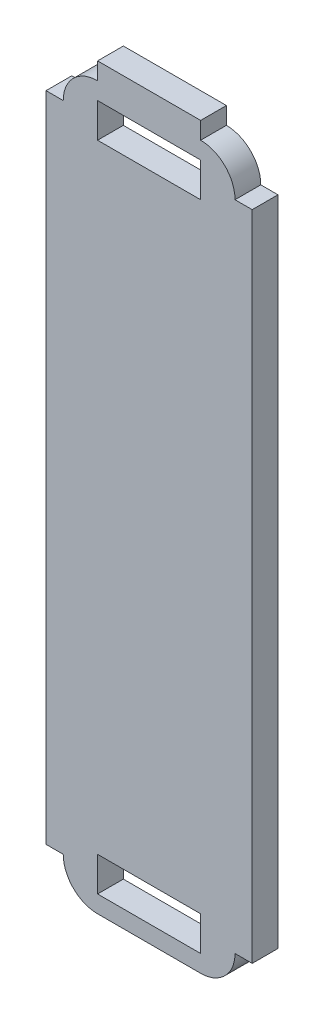
ISO-10303-21;
HEADER;
FILE_DESCRIPTION(('STEP AP214'),'2;1');
FILE_NAME('part.step','',(''),(''),'','','');
FILE_SCHEMA(('AUTOMOTIVE_DESIGN { 1 0 10303 214 1 1 1 1 }'));
ENDSEC;
DATA;
#1=APPLICATION_CONTEXT('core data for automotive mechanical design processes');
#2=APPLICATION_PROTOCOL_DEFINITION('international standard','automotive_design',2000,#1);
#3=PRODUCT_CONTEXT('',#1,'mechanical');
#4=PRODUCT('Part','Part','',(#3));
#5=PRODUCT_RELATED_PRODUCT_CATEGORY('part','',(#4));
#6=PRODUCT_DEFINITION_FORMATION('','',#4);
#7=PRODUCT_DEFINITION_CONTEXT('part definition',#1,'design');
#8=PRODUCT_DEFINITION('design','',#6,#7);
#9=PRODUCT_DEFINITION_SHAPE('','',#8);
#10=(LENGTH_UNIT() NAMED_UNIT(*) SI_UNIT(.MILLI.,.METRE.));
#11=(NAMED_UNIT(*) PLANE_ANGLE_UNIT() SI_UNIT($,.RADIAN.));
#12=(NAMED_UNIT(*) SI_UNIT($,.STERADIAN.) SOLID_ANGLE_UNIT());
#13=UNCERTAINTY_MEASURE_WITH_UNIT(LENGTH_MEASURE(1.E-05),#10,'distance_accuracy_value','');
#14=(GEOMETRIC_REPRESENTATION_CONTEXT(3) GLOBAL_UNCERTAINTY_ASSIGNED_CONTEXT((#13)) GLOBAL_UNIT_ASSIGNED_CONTEXT((#10,
#11,#12)) REPRESENTATION_CONTEXT('',''));
#15=CARTESIAN_POINT('',(0.,0.,0.));
#16=DIRECTION('',(0.,0.,1.));
#17=DIRECTION('',(1.,0.,0.));
#18=AXIS2_PLACEMENT_3D('',#15,#16,#17);
#19=CARTESIAN_POINT('',(0.,0.,1.5));
#20=DIRECTION('',(0.,1.,0.));
#21=DIRECTION('',(0.,0.,1.));
#22=AXIS2_PLACEMENT_3D('',#19,#20,#21);
#23=PLANE('',#22);
#24=DIRECTION('',(1.,0.,0.));
#25=VECTOR('',#24,1.);
#26=CARTESIAN_POINT('',(0.,0.,0.));
#27=LINE('',#26,#25);
#28=CARTESIAN_POINT('',(2.,0.,0.));
#29=VERTEX_POINT('',#28);
#30=CARTESIAN_POINT('',(8.,0.,0.));
#31=VERTEX_POINT('',#30);
#32=EDGE_CURVE('E370',#29,#31,#27,.T.);
#33=ORIENTED_EDGE('',*,*,#32,.T.);
#34=DIRECTION('',(0.,0.,-1.));
#35=VECTOR('',#34,1.);
#36=CARTESIAN_POINT('',(8.,0.,1.5));
#37=LINE('',#36,#35);
#38=CARTESIAN_POINT('',(8.,0.,1.5));
#39=VERTEX_POINT('',#38);
#40=EDGE_CURVE('E402',#31,#39,#37,.F.);
#41=ORIENTED_EDGE('',*,*,#40,.T.);
#42=DIRECTION('',(1.,0.,0.));
#43=VECTOR('',#42,1.);
#44=CARTESIAN_POINT('',(0.,0.,1.5));
#45=LINE('',#44,#43);
#46=CARTESIAN_POINT('',(2.,0.,1.5));
#47=VERTEX_POINT('',#46);
#48=EDGE_CURVE('E371',#47,#39,#45,.T.);
#49=ORIENTED_EDGE('',*,*,#48,.F.);
#50=DIRECTION('',(0.,0.,-1.));
#51=VECTOR('',#50,1.);
#52=CARTESIAN_POINT('',(2.,0.,1.5));
#53=LINE('',#52,#51);
#54=EDGE_CURVE('E398',#47,#29,#53,.T.);
#55=ORIENTED_EDGE('',*,*,#54,.T.);
#56=EDGE_LOOP('',(#33,#41,#49,#55));
#57=FACE_BOUND('',#56,.T.);
#58=ADVANCED_FACE('F39',(#57),#23,.F.);
#59=CARTESIAN_POINT('',(0.,0.,1.5));
#60=DIRECTION('',(0.,0.,-1.));
#61=DIRECTION('',(-1.,0.,0.));
#62=AXIS2_PLACEMENT_3D('',#59,#60,#61);
#63=PLANE('',#62);
#64=DIRECTION('',(1.,0.,0.));
#65=VECTOR('',#64,1.);
#66=CARTESIAN_POINT('',(8.,41.,1.5));
#67=LINE('',#66,#65);
#68=CARTESIAN_POINT('',(2.,41.,1.5));
#69=VERTEX_POINT('',#68);
#70=CARTESIAN_POINT('',(8.,41.,1.5));
#71=VERTEX_POINT('',#70);
#72=EDGE_CURVE('E202',#69,#71,#67,.T.);
#73=ORIENTED_EDGE('',*,*,#72,.T.);
#74=DIRECTION('',(0.,-1.,0.));
#75=VECTOR('',#74,1.);
#76=CARTESIAN_POINT('',(8.,41.,1.5));
#77=LINE('',#76,#75);
#78=CARTESIAN_POINT('',(8.,39.,1.5));
#79=VERTEX_POINT('',#78);
#80=EDGE_CURVE('E193',#71,#79,#77,.T.);
#81=ORIENTED_EDGE('',*,*,#80,.T.);
#82=DIRECTION('',(-1.,0.,0.));
#83=VECTOR('',#82,1.);
#84=CARTESIAN_POINT('',(8.,39.,1.5));
#85=LINE('',#84,#83);
#86=CARTESIAN_POINT('',(2.,39.,1.5));
#87=VERTEX_POINT('',#86);
#88=EDGE_CURVE('E205',#79,#87,#85,.T.);
#89=ORIENTED_EDGE('',*,*,#88,.T.);
#90=DIRECTION('',(0.,1.,0.));
#91=VECTOR('',#90,1.);
#92=CARTESIAN_POINT('',(2.,41.,1.5));
#93=LINE('',#92,#91);
#94=EDGE_CURVE('E55',#87,#69,#93,.T.);
#95=ORIENTED_EDGE('',*,*,#94,.T.);
#96=EDGE_LOOP('',(#73,#81,#89,#95));
#97=FACE_BOUND('',#96,.T.);
#98=DIRECTION('',(-1.,0.,0.));
#99=VECTOR('',#98,1.);
#100=CARTESIAN_POINT('',(2.,0.999999999999999,1.5));
#101=LINE('',#100,#99);
#102=CARTESIAN_POINT('',(8.,0.999999999999999,1.5));
#103=VERTEX_POINT('',#102);
#104=CARTESIAN_POINT('',(2.,0.999999999999999,1.5));
#105=VERTEX_POINT('',#104);
#106=EDGE_CURVE('E254',#103,#105,#101,.T.);
#107=ORIENTED_EDGE('',*,*,#106,.T.);
#108=DIRECTION('',(0.,1.,0.));
#109=VECTOR('',#108,1.);
#110=CARTESIAN_POINT('',(2.,0.999999999999999,1.5));
#111=LINE('',#110,#109);
#112=CARTESIAN_POINT('',(2.,3.,1.5));
#113=VERTEX_POINT('',#112);
#114=EDGE_CURVE('E243',#105,#113,#111,.T.);
#115=ORIENTED_EDGE('',*,*,#114,.T.);
#116=DIRECTION('',(1.,0.,0.));
#117=VECTOR('',#116,1.);
#118=CARTESIAN_POINT('',(2.,3.,1.5));
#119=LINE('',#118,#117);
#120=CARTESIAN_POINT('',(8.,3.,1.5));
#121=VERTEX_POINT('',#120);
#122=EDGE_CURVE('E247',#113,#121,#119,.T.);
#123=ORIENTED_EDGE('',*,*,#122,.T.);
#124=DIRECTION('',(0.,-1.,0.));
#125=VECTOR('',#124,1.);
#126=CARTESIAN_POINT('',(8.,0.999999999999999,1.5));
#127=LINE('',#126,#125);
#128=EDGE_CURVE('E63',#121,#103,#127,.T.);
#129=ORIENTED_EDGE('',*,*,#128,.T.);
#130=EDGE_LOOP('',(#107,#115,#123,#129));
#131=FACE_BOUND('',#130,.T.);
#132=ORIENTED_EDGE('',*,*,#48,.T.);
#133=CARTESIAN_POINT('',(8.,2.,1.5));
#134=DIRECTION('',(0.,0.,-1.));
#135=DIRECTION('',(-1.,0.,0.));
#136=AXIS2_PLACEMENT_3D('',#133,#134,#135);
#137=CIRCLE('',#136,2.);
#138=CARTESIAN_POINT('',(10.,2.,1.5));
#139=VERTEX_POINT('',#138);
#140=EDGE_CURVE('E414',#39,#139,#137,.F.);
#141=ORIENTED_EDGE('',*,*,#140,.T.);
#142=DIRECTION('',(-1.,0.,0.));
#143=VECTOR('',#142,1.);
#144=CARTESIAN_POINT('',(11.,2.,1.5));
#145=LINE('',#144,#143);
#146=CARTESIAN_POINT('',(11.,2.,1.5));
#147=VERTEX_POINT('',#146);
#148=EDGE_CURVE('E366',#147,#139,#145,.T.);
#149=ORIENTED_EDGE('',*,*,#148,.F.);
#150=DIRECTION('',(0.,-1.,0.));
#151=VECTOR('',#150,1.);
#152=CARTESIAN_POINT('',(11.,40.,1.5));
#153=LINE('',#152,#151);
#154=CARTESIAN_POINT('',(11.,40.,1.5));
#155=VERTEX_POINT('',#154);
#156=EDGE_CURVE('E341',#155,#147,#153,.T.);
#157=ORIENTED_EDGE('',*,*,#156,.F.);
#158=DIRECTION('',(-1.,0.,0.));
#159=VECTOR('',#158,1.);
#160=CARTESIAN_POINT('',(11.,40.,1.5));
#161=LINE('',#160,#159);
#162=CARTESIAN_POINT('',(10.,40.,1.5));
#163=VERTEX_POINT('',#162);
#164=EDGE_CURVE('E354',#155,#163,#161,.T.);
#165=ORIENTED_EDGE('',*,*,#164,.T.);
#166=CARTESIAN_POINT('',(8.,40.,1.5));
#167=DIRECTION('',(0.,0.,-1.));
#168=DIRECTION('',(-1.,0.,0.));
#169=AXIS2_PLACEMENT_3D('',#166,#167,#168);
#170=CIRCLE('',#169,2.);
#171=CARTESIAN_POINT('',(8.,42.,1.5));
#172=VERTEX_POINT('',#171);
#173=EDGE_CURVE('E408',#163,#172,#170,.F.);
#174=ORIENTED_EDGE('',*,*,#173,.T.);
#175=DIRECTION('',(0.,-1.,0.));
#176=VECTOR('',#175,1.);
#177=CARTESIAN_POINT('',(8.,43.,1.5));
#178=LINE('',#177,#176);
#179=CARTESIAN_POINT('',(8.,43.,1.5));
#180=VERTEX_POINT('',#179);
#181=EDGE_CURVE('E304',#180,#172,#178,.T.);
#182=ORIENTED_EDGE('',*,*,#181,.F.);
#183=DIRECTION('',(1.,0.,0.));
#184=VECTOR('',#183,1.);
#185=CARTESIAN_POINT('',(2.,43.,1.5));
#186=LINE('',#185,#184);
#187=CARTESIAN_POINT('',(2.,43.,1.5));
#188=VERTEX_POINT('',#187);
#189=EDGE_CURVE('E287',#188,#180,#186,.T.);
#190=ORIENTED_EDGE('',*,*,#189,.F.);
#191=DIRECTION('',(0.,-1.,0.));
#192=VECTOR('',#191,1.);
#193=CARTESIAN_POINT('',(2.,43.,1.5));
#194=LINE('',#193,#192);
#195=CARTESIAN_POINT('',(2.,42.,1.5));
#196=VERTEX_POINT('',#195);
#197=EDGE_CURVE('E308',#188,#196,#194,.T.);
#198=ORIENTED_EDGE('',*,*,#197,.T.);
#199=CARTESIAN_POINT('',(2.,40.,1.5));
#200=DIRECTION('',(0.,0.,-1.));
#201=DIRECTION('',(-1.,0.,0.));
#202=AXIS2_PLACEMENT_3D('',#199,#200,#201);
#203=CIRCLE('',#202,2.);
#204=CARTESIAN_POINT('',(0.,40.,1.5));
#205=VERTEX_POINT('',#204);
#206=EDGE_CURVE('E405',#196,#205,#203,.F.);
#207=ORIENTED_EDGE('',*,*,#206,.T.);
#208=DIRECTION('',(1.,0.,0.));
#209=VECTOR('',#208,1.);
#210=CARTESIAN_POINT('',(-1.,40.,1.5));
#211=LINE('',#210,#209);
#212=CARTESIAN_POINT('',(-1.,40.,1.5));
#213=VERTEX_POINT('',#212);
#214=EDGE_CURVE('E329',#213,#205,#211,.T.);
#215=ORIENTED_EDGE('',*,*,#214,.F.);
#216=DIRECTION('',(0.,1.,0.));
#217=VECTOR('',#216,1.);
#218=CARTESIAN_POINT('',(-1.,40.,1.5));
#219=LINE('',#218,#217);
#220=CARTESIAN_POINT('',(-1.,2.,1.5));
#221=VERTEX_POINT('',#220);
#222=EDGE_CURVE('E319',#221,#213,#219,.T.);
#223=ORIENTED_EDGE('',*,*,#222,.F.);
#224=DIRECTION('',(1.,0.,0.));
#225=VECTOR('',#224,1.);
#226=CARTESIAN_POINT('',(-1.,2.,1.5));
#227=LINE('',#226,#225);
#228=CARTESIAN_POINT('',(0.,2.,1.5));
#229=VERTEX_POINT('',#228);
#230=EDGE_CURVE('E333',#221,#229,#227,.T.);
#231=ORIENTED_EDGE('',*,*,#230,.T.);
#232=CARTESIAN_POINT('',(2.,2.,1.5));
#233=DIRECTION('',(0.,0.,-1.));
#234=DIRECTION('',(-1.,0.,0.));
#235=AXIS2_PLACEMENT_3D('',#232,#233,#234);
#236=CIRCLE('',#235,2.);
#237=EDGE_CURVE('E411',#229,#47,#236,.F.);
#238=ORIENTED_EDGE('',*,*,#237,.T.);
#239=EDGE_LOOP('',(#132,#141,#149,#157,#165,#174,#182,#190,#198,#207,#215,#223,#231,#238));
#240=FACE_BOUND('',#239,.T.);
#241=ADVANCED_FACE('F210',(#97,#131,#240),#63,.F.);
#242=CARTESIAN_POINT('',(0.,0.,0.));
#243=DIRECTION('',(0.,0.,-1.));
#244=DIRECTION('',(-1.,0.,0.));
#245=AXIS2_PLACEMENT_3D('',#242,#243,#244);
#246=PLANE('',#245);
#247=DIRECTION('',(0.,-1.,0.));
#248=VECTOR('',#247,1.);
#249=CARTESIAN_POINT('',(8.,41.,0.));
#250=LINE('',#249,#248);
#251=CARTESIAN_POINT('',(8.,41.,0.));
#252=VERTEX_POINT('',#251);
#253=CARTESIAN_POINT('',(8.,39.,0.));
#254=VERTEX_POINT('',#253);
#255=EDGE_CURVE('E196',#252,#254,#250,.T.);
#256=ORIENTED_EDGE('',*,*,#255,.F.);
#257=DIRECTION('',(1.,0.,0.));
#258=VECTOR('',#257,1.);
#259=CARTESIAN_POINT('',(8.,41.,0.));
#260=LINE('',#259,#258);
#261=CARTESIAN_POINT('',(2.,41.,0.));
#262=VERTEX_POINT('',#261);
#263=EDGE_CURVE('E214',#262,#252,#260,.T.);
#264=ORIENTED_EDGE('',*,*,#263,.F.);
#265=DIRECTION('',(0.,1.,0.));
#266=VECTOR('',#265,1.);
#267=CARTESIAN_POINT('',(2.,41.,0.));
#268=LINE('',#267,#266);
#269=CARTESIAN_POINT('',(2.,39.,0.));
#270=VERTEX_POINT('',#269);
#271=EDGE_CURVE('E218',#270,#262,#268,.T.);
#272=ORIENTED_EDGE('',*,*,#271,.F.);
#273=DIRECTION('',(-1.,0.,0.));
#274=VECTOR('',#273,1.);
#275=CARTESIAN_POINT('',(8.,39.,0.));
#276=LINE('',#275,#274);
#277=EDGE_CURVE('E227',#254,#270,#276,.T.);
#278=ORIENTED_EDGE('',*,*,#277,.F.);
#279=EDGE_LOOP('',(#256,#264,#272,#278));
#280=FACE_BOUND('',#279,.T.);
#281=DIRECTION('',(0.,1.,0.));
#282=VECTOR('',#281,1.);
#283=CARTESIAN_POINT('',(2.,0.999999999999999,0.));
#284=LINE('',#283,#282);
#285=CARTESIAN_POINT('',(2.,0.999999999999999,0.));
#286=VERTEX_POINT('',#285);
#287=CARTESIAN_POINT('',(2.,3.,0.));
#288=VERTEX_POINT('',#287);
#289=EDGE_CURVE('E259',#286,#288,#284,.T.);
#290=ORIENTED_EDGE('',*,*,#289,.F.);
#291=DIRECTION('',(-1.,0.,0.));
#292=VECTOR('',#291,1.);
#293=CARTESIAN_POINT('',(2.,0.999999999999999,0.));
#294=LINE('',#293,#292);
#295=CARTESIAN_POINT('',(8.,0.999999999999999,0.));
#296=VERTEX_POINT('',#295);
#297=EDGE_CURVE('E248',#296,#286,#294,.T.);
#298=ORIENTED_EDGE('',*,*,#297,.F.);
#299=DIRECTION('',(0.,-1.,0.));
#300=VECTOR('',#299,1.);
#301=CARTESIAN_POINT('',(8.,0.999999999999999,0.));
#302=LINE('',#301,#300);
#303=CARTESIAN_POINT('',(8.,3.,0.));
#304=VERTEX_POINT('',#303);
#305=EDGE_CURVE('E266',#304,#296,#302,.T.);
#306=ORIENTED_EDGE('',*,*,#305,.F.);
#307=DIRECTION('',(1.,0.,0.));
#308=VECTOR('',#307,1.);
#309=CARTESIAN_POINT('',(2.,3.,0.));
#310=LINE('',#309,#308);
#311=EDGE_CURVE('E262',#288,#304,#310,.T.);
#312=ORIENTED_EDGE('',*,*,#311,.F.);
#313=EDGE_LOOP('',(#290,#298,#306,#312));
#314=FACE_BOUND('',#313,.T.);
#315=CARTESIAN_POINT('',(8.,40.,0.));
#316=DIRECTION('',(0.,0.,-1.));
#317=DIRECTION('',(-1.,0.,0.));
#318=AXIS2_PLACEMENT_3D('',#315,#316,#317);
#319=CIRCLE('',#318,2.);
#320=CARTESIAN_POINT('',(8.,42.,0.));
#321=VERTEX_POINT('',#320);
#322=CARTESIAN_POINT('',(10.,40.,0.));
#323=VERTEX_POINT('',#322);
#324=EDGE_CURVE('E389',#321,#323,#319,.T.);
#325=ORIENTED_EDGE('',*,*,#324,.T.);
#326=DIRECTION('',(-1.,0.,0.));
#327=VECTOR('',#326,1.);
#328=CARTESIAN_POINT('',(11.,40.,0.));
#329=LINE('',#328,#327);
#330=CARTESIAN_POINT('',(11.,40.,0.));
#331=VERTEX_POINT('',#330);
#332=EDGE_CURVE('E358',#331,#323,#329,.T.);
#333=ORIENTED_EDGE('',*,*,#332,.F.);
#334=DIRECTION('',(0.,1.,0.));
#335=VECTOR('',#334,1.);
#336=CARTESIAN_POINT('',(11.,40.,0.));
#337=LINE('',#336,#335);
#338=CARTESIAN_POINT('',(11.,2.,0.));
#339=VERTEX_POINT('',#338);
#340=EDGE_CURVE('E348',#339,#331,#337,.T.);
#341=ORIENTED_EDGE('',*,*,#340,.F.);
#342=DIRECTION('',(-1.,0.,0.));
#343=VECTOR('',#342,1.);
#344=CARTESIAN_POINT('',(11.,2.,0.));
#345=LINE('',#344,#343);
#346=CARTESIAN_POINT('',(10.,2.,0.));
#347=VERTEX_POINT('',#346);
#348=EDGE_CURVE('E362',#339,#347,#345,.T.);
#349=ORIENTED_EDGE('',*,*,#348,.T.);
#350=CARTESIAN_POINT('',(8.,2.,0.));
#351=DIRECTION('',(0.,0.,-1.));
#352=DIRECTION('',(-1.,0.,0.));
#353=AXIS2_PLACEMENT_3D('',#350,#351,#352);
#354=CIRCLE('',#353,2.);
#355=EDGE_CURVE('E395',#347,#31,#354,.T.);
#356=ORIENTED_EDGE('',*,*,#355,.T.);
#357=ORIENTED_EDGE('',*,*,#32,.F.);
#358=CARTESIAN_POINT('',(2.,2.,0.));
#359=DIRECTION('',(0.,0.,-1.));
#360=DIRECTION('',(-1.,0.,0.));
#361=AXIS2_PLACEMENT_3D('',#358,#359,#360);
#362=CIRCLE('',#361,2.);
#363=CARTESIAN_POINT('',(0.,2.,0.));
#364=VERTEX_POINT('',#363);
#365=EDGE_CURVE('E392',#29,#364,#362,.T.);
#366=ORIENTED_EDGE('',*,*,#365,.T.);
#367=DIRECTION('',(1.,0.,0.));
#368=VECTOR('',#367,1.);
#369=CARTESIAN_POINT('',(-1.,2.,0.));
#370=LINE('',#369,#368);
#371=CARTESIAN_POINT('',(-1.,2.,0.));
#372=VERTEX_POINT('',#371);
#373=EDGE_CURVE('E337',#372,#364,#370,.T.);
#374=ORIENTED_EDGE('',*,*,#373,.F.);
#375=DIRECTION('',(0.,-1.,0.));
#376=VECTOR('',#375,1.);
#377=CARTESIAN_POINT('',(-1.,40.,0.));
#378=LINE('',#377,#376);
#379=CARTESIAN_POINT('',(-1.,40.,0.));
#380=VERTEX_POINT('',#379);
#381=EDGE_CURVE('E312',#380,#372,#378,.T.);
#382=ORIENTED_EDGE('',*,*,#381,.F.);
#383=DIRECTION('',(1.,0.,0.));
#384=VECTOR('',#383,1.);
#385=CARTESIAN_POINT('',(-1.,40.,0.));
#386=LINE('',#385,#384);
#387=CARTESIAN_POINT('',(0.,40.,0.));
#388=VERTEX_POINT('',#387);
#389=EDGE_CURVE('E325',#380,#388,#386,.T.);
#390=ORIENTED_EDGE('',*,*,#389,.T.);
#391=CARTESIAN_POINT('',(2.,40.,0.));
#392=DIRECTION('',(0.,0.,-1.));
#393=DIRECTION('',(-1.,0.,0.));
#394=AXIS2_PLACEMENT_3D('',#391,#392,#393);
#395=CIRCLE('',#394,2.);
#396=CARTESIAN_POINT('',(2.,42.,0.));
#397=VERTEX_POINT('',#396);
#398=EDGE_CURVE('E386',#388,#397,#395,.T.);
#399=ORIENTED_EDGE('',*,*,#398,.T.);
#400=DIRECTION('',(0.,-1.,0.));
#401=VECTOR('',#400,1.);
#402=CARTESIAN_POINT('',(2.,43.,0.));
#403=LINE('',#402,#401);
#404=CARTESIAN_POINT('',(2.,43.,0.));
#405=VERTEX_POINT('',#404);
#406=EDGE_CURVE('E296',#405,#397,#403,.T.);
#407=ORIENTED_EDGE('',*,*,#406,.F.);
#408=DIRECTION('',(-1.,0.,0.));
#409=VECTOR('',#408,1.);
#410=CARTESIAN_POINT('',(2.,43.,0.));
#411=LINE('',#410,#409);
#412=CARTESIAN_POINT('',(8.,43.,0.));
#413=VERTEX_POINT('',#412);
#414=EDGE_CURVE('E293',#413,#405,#411,.T.);
#415=ORIENTED_EDGE('',*,*,#414,.F.);
#416=DIRECTION('',(0.,-1.,0.));
#417=VECTOR('',#416,1.);
#418=CARTESIAN_POINT('',(8.,43.,0.));
#419=LINE('',#418,#417);
#420=EDGE_CURVE('E300',#413,#321,#419,.T.);
#421=ORIENTED_EDGE('',*,*,#420,.T.);
#422=EDGE_LOOP('',(#325,#333,#341,#349,#356,#357,#366,#374,#382,#390,#399,#407,#415,#421));
#423=FACE_BOUND('',#422,.T.);
#424=ADVANCED_FACE('F443',(#280,#314,#423),#246,.T.);
#425=CARTESIAN_POINT('',(8.,2.,1.5));
#426=DIRECTION('',(0.,0.,-1.));
#427=DIRECTION('',(-1.,0.,0.));
#428=AXIS2_PLACEMENT_3D('',#425,#426,#427);
#429=CYLINDRICAL_SURFACE('',#428,2.);
#430=ORIENTED_EDGE('',*,*,#140,.F.);
#431=ORIENTED_EDGE('',*,*,#40,.F.);
#432=ORIENTED_EDGE('',*,*,#355,.F.);
#433=DIRECTION('',(0.,0.,-1.));
#434=VECTOR('',#433,1.);
#435=CARTESIAN_POINT('',(10.,2.,1.5));
#436=LINE('',#435,#434);
#437=EDGE_CURVE('E382',#139,#347,#436,.T.);
#438=ORIENTED_EDGE('',*,*,#437,.F.);
#439=EDGE_LOOP('',(#430,#431,#432,#438));
#440=FACE_BOUND('',#439,.T.);
#441=ADVANCED_FACE('F466',(#440),#429,.T.);
#442=CARTESIAN_POINT('',(2.,2.,1.5));
#443=DIRECTION('',(0.,0.,-1.));
#444=DIRECTION('',(-1.,0.,0.));
#445=AXIS2_PLACEMENT_3D('',#442,#443,#444);
#446=CYLINDRICAL_SURFACE('',#445,2.);
#447=ORIENTED_EDGE('',*,*,#237,.F.);
#448=DIRECTION('',(0.,0.,-1.));
#449=VECTOR('',#448,1.);
#450=CARTESIAN_POINT('',(0.,2.,1.5));
#451=LINE('',#450,#449);
#452=EDGE_CURVE('E421',#364,#229,#451,.F.);
#453=ORIENTED_EDGE('',*,*,#452,.F.);
#454=ORIENTED_EDGE('',*,*,#365,.F.);
#455=ORIENTED_EDGE('',*,*,#54,.F.);
#456=EDGE_LOOP('',(#447,#453,#454,#455));
#457=FACE_BOUND('',#456,.T.);
#458=ADVANCED_FACE('F458',(#457),#446,.T.);
#459=CARTESIAN_POINT('',(8.,40.,1.5));
#460=DIRECTION('',(0.,0.,-1.));
#461=DIRECTION('',(-1.,0.,0.));
#462=AXIS2_PLACEMENT_3D('',#459,#460,#461);
#463=CYLINDRICAL_SURFACE('',#462,2.);
#464=ORIENTED_EDGE('',*,*,#173,.F.);
#465=DIRECTION('',(0.,0.,-1.));
#466=VECTOR('',#465,1.);
#467=CARTESIAN_POINT('',(10.,40.,1.5));
#468=LINE('',#467,#466);
#469=EDGE_CURVE('E375',#323,#163,#468,.F.);
#470=ORIENTED_EDGE('',*,*,#469,.F.);
#471=ORIENTED_EDGE('',*,*,#324,.F.);
#472=DIRECTION('',(0.,0.,-1.));
#473=VECTOR('',#472,1.);
#474=CARTESIAN_POINT('',(8.,42.,1.5));
#475=LINE('',#474,#473);
#476=EDGE_CURVE('E11',#172,#321,#475,.T.);
#477=ORIENTED_EDGE('',*,*,#476,.F.);
#478=EDGE_LOOP('',(#464,#470,#471,#477));
#479=FACE_BOUND('',#478,.T.);
#480=ADVANCED_FACE('F484',(#479),#463,.T.);
#481=CARTESIAN_POINT('',(2.,40.,1.5));
#482=DIRECTION('',(0.,0.,-1.));
#483=DIRECTION('',(-1.,0.,0.));
#484=AXIS2_PLACEMENT_3D('',#481,#482,#483);
#485=CYLINDRICAL_SURFACE('',#484,2.);
#486=ORIENTED_EDGE('',*,*,#206,.F.);
#487=DIRECTION('',(0.,0.,-1.));
#488=VECTOR('',#487,1.);
#489=CARTESIAN_POINT('',(2.,42.,1.5));
#490=LINE('',#489,#488);
#491=EDGE_CURVE('E48',#397,#196,#490,.F.);
#492=ORIENTED_EDGE('',*,*,#491,.F.);
#493=ORIENTED_EDGE('',*,*,#398,.F.);
#494=DIRECTION('',(0.,0.,-1.));
#495=VECTOR('',#494,1.);
#496=CARTESIAN_POINT('',(0.,40.,1.5));
#497=LINE('',#496,#495);
#498=EDGE_CURVE('E417',#205,#388,#497,.T.);
#499=ORIENTED_EDGE('',*,*,#498,.F.);
#500=EDGE_LOOP('',(#486,#492,#493,#499));
#501=FACE_BOUND('',#500,.T.);
#502=ADVANCED_FACE('F41',(#501),#485,.T.);
#503=CARTESIAN_POINT('',(11.,2.,1.5));
#504=DIRECTION('',(0.,1.,0.));
#505=DIRECTION('',(0.,0.,1.));
#506=AXIS2_PLACEMENT_3D('',#503,#504,#505);
#507=PLANE('',#506);
#508=ORIENTED_EDGE('',*,*,#437,.T.);
#509=ORIENTED_EDGE('',*,*,#348,.F.);
#510=DIRECTION('',(0.,0.,-1.));
#511=VECTOR('',#510,1.);
#512=CARTESIAN_POINT('',(11.,2.,1.5));
#513=LINE('',#512,#511);
#514=EDGE_CURVE('E345',#147,#339,#513,.T.);
#515=ORIENTED_EDGE('',*,*,#514,.F.);
#516=ORIENTED_EDGE('',*,*,#148,.T.);
#517=EDGE_LOOP('',(#508,#509,#515,#516));
#518=FACE_BOUND('',#517,.T.);
#519=ADVANCED_FACE('F471',(#518),#507,.F.);
#520=CARTESIAN_POINT('',(11.,40.,1.5));
#521=DIRECTION('',(0.,-1.,0.));
#522=DIRECTION('',(0.,0.,-1.));
#523=AXIS2_PLACEMENT_3D('',#520,#521,#522);
#524=PLANE('',#523);
#525=ORIENTED_EDGE('',*,*,#469,.T.);
#526=ORIENTED_EDGE('',*,*,#164,.F.);
#527=DIRECTION('',(0.,0.,1.));
#528=VECTOR('',#527,1.);
#529=CARTESIAN_POINT('',(11.,40.,1.5));
#530=LINE('',#529,#528);
#531=EDGE_CURVE('E351',#331,#155,#530,.T.);
#532=ORIENTED_EDGE('',*,*,#531,.F.);
#533=ORIENTED_EDGE('',*,*,#332,.T.);
#534=EDGE_LOOP('',(#525,#526,#532,#533));
#535=FACE_BOUND('',#534,.T.);
#536=ADVANCED_FACE('F480',(#535),#524,.F.);
#537=CARTESIAN_POINT('',(11.,0.,0.));
#538=DIRECTION('',(1.,0.,0.));
#539=DIRECTION('',(0.,0.,-1.));
#540=AXIS2_PLACEMENT_3D('',#537,#538,#539);
#541=PLANE('',#540);
#542=ORIENTED_EDGE('',*,*,#156,.T.);
#543=ORIENTED_EDGE('',*,*,#514,.T.);
#544=ORIENTED_EDGE('',*,*,#340,.T.);
#545=ORIENTED_EDGE('',*,*,#531,.T.);
#546=EDGE_LOOP('',(#542,#543,#544,#545));
#547=FACE_BOUND('',#546,.T.);
#548=ADVANCED_FACE('F475',(#547),#541,.T.);
#549=CARTESIAN_POINT('',(-1.,2.,0.));
#550=DIRECTION('',(0.,1.,0.));
#551=DIRECTION('',(0.,0.,1.));
#552=AXIS2_PLACEMENT_3D('',#549,#550,#551);
#553=PLANE('',#552);
#554=ORIENTED_EDGE('',*,*,#452,.T.);
#555=ORIENTED_EDGE('',*,*,#230,.F.);
#556=DIRECTION('',(0.,0.,1.));
#557=VECTOR('',#556,1.);
#558=CARTESIAN_POINT('',(-1.,2.,0.));
#559=LINE('',#558,#557);
#560=EDGE_CURVE('E316',#372,#221,#559,.T.);
#561=ORIENTED_EDGE('',*,*,#560,.F.);
#562=ORIENTED_EDGE('',*,*,#373,.T.);
#563=EDGE_LOOP('',(#554,#555,#561,#562));
#564=FACE_BOUND('',#563,.T.);
#565=ADVANCED_FACE('F455',(#564),#553,.F.);
#566=CARTESIAN_POINT('',(-1.,40.,0.));
#567=DIRECTION('',(0.,-1.,0.));
#568=DIRECTION('',(0.,0.,-1.));
#569=AXIS2_PLACEMENT_3D('',#566,#567,#568);
#570=PLANE('',#569);
#571=ORIENTED_EDGE('',*,*,#498,.T.);
#572=ORIENTED_EDGE('',*,*,#389,.F.);
#573=DIRECTION('',(0.,0.,-1.));
#574=VECTOR('',#573,1.);
#575=CARTESIAN_POINT('',(-1.,40.,0.));
#576=LINE('',#575,#574);
#577=EDGE_CURVE('E322',#213,#380,#576,.T.);
#578=ORIENTED_EDGE('',*,*,#577,.F.);
#579=ORIENTED_EDGE('',*,*,#214,.T.);
#580=EDGE_LOOP('',(#571,#572,#578,#579));
#581=FACE_BOUND('',#580,.T.);
#582=ADVANCED_FACE('F449',(#581),#570,.F.);
#583=CARTESIAN_POINT('',(-1.,0.,0.));
#584=DIRECTION('',(-1.,0.,0.));
#585=DIRECTION('',(0.,0.,1.));
#586=AXIS2_PLACEMENT_3D('',#583,#584,#585);
#587=PLANE('',#586);
#588=ORIENTED_EDGE('',*,*,#381,.T.);
#589=ORIENTED_EDGE('',*,*,#560,.T.);
#590=ORIENTED_EDGE('',*,*,#222,.T.);
#591=ORIENTED_EDGE('',*,*,#577,.T.);
#592=EDGE_LOOP('',(#588,#589,#590,#591));
#593=FACE_BOUND('',#592,.T.);
#594=ADVANCED_FACE('F453',(#593),#587,.T.);
#595=CARTESIAN_POINT('',(2.,43.,0.));
#596=DIRECTION('',(1.,0.,0.));
#597=DIRECTION('',(0.,0.,-1.));
#598=AXIS2_PLACEMENT_3D('',#595,#596,#597);
#599=PLANE('',#598);
#600=ORIENTED_EDGE('',*,*,#491,.T.);
#601=ORIENTED_EDGE('',*,*,#197,.F.);
#602=DIRECTION('',(0.,0.,1.));
#603=VECTOR('',#602,1.);
#604=CARTESIAN_POINT('',(2.,43.,0.));
#605=LINE('',#604,#603);
#606=EDGE_CURVE('E237',#405,#188,#605,.T.);
#607=ORIENTED_EDGE('',*,*,#606,.F.);
#608=ORIENTED_EDGE('',*,*,#406,.T.);
#609=EDGE_LOOP('',(#600,#601,#607,#608));
#610=FACE_BOUND('',#609,.T.);
#611=ADVANCED_FACE('F429',(#610),#599,.F.);
#612=CARTESIAN_POINT('',(8.,43.,0.));
#613=DIRECTION('',(-1.,0.,0.));
#614=DIRECTION('',(0.,0.,1.));
#615=AXIS2_PLACEMENT_3D('',#612,#613,#614);
#616=PLANE('',#615);
#617=ORIENTED_EDGE('',*,*,#476,.T.);
#618=ORIENTED_EDGE('',*,*,#420,.F.);
#619=DIRECTION('',(0.,0.,-1.));
#620=VECTOR('',#619,1.);
#621=CARTESIAN_POINT('',(8.,43.,0.));
#622=LINE('',#621,#620);
#623=EDGE_CURVE('E290',#180,#413,#622,.T.);
#624=ORIENTED_EDGE('',*,*,#623,.F.);
#625=ORIENTED_EDGE('',*,*,#181,.T.);
#626=EDGE_LOOP('',(#617,#618,#624,#625));
#627=FACE_BOUND('',#626,.T.);
#628=ADVANCED_FACE('F486',(#627),#616,.F.);
#629=CARTESIAN_POINT('',(0.,43.,0.));
#630=DIRECTION('',(0.,1.,0.));
#631=DIRECTION('',(0.,0.,1.));
#632=AXIS2_PLACEMENT_3D('',#629,#630,#631);
#633=PLANE('',#632);
#634=ORIENTED_EDGE('',*,*,#606,.T.);
#635=ORIENTED_EDGE('',*,*,#189,.T.);
#636=ORIENTED_EDGE('',*,*,#623,.T.);
#637=ORIENTED_EDGE('',*,*,#414,.T.);
#638=EDGE_LOOP('',(#634,#635,#636,#637));
#639=FACE_BOUND('',#638,.T.);
#640=ADVANCED_FACE('F439',(#639),#633,.T.);
#641=CARTESIAN_POINT('',(2.,0.999999999999999,1.5));
#642=DIRECTION('',(-1.,0.,0.));
#643=DIRECTION('',(0.,-1.,0.));
#644=AXIS2_PLACEMENT_3D('',#641,#642,#643);
#645=PLANE('',#644);
#646=ORIENTED_EDGE('',*,*,#289,.T.);
#647=DIRECTION('',(0.,0.,-1.));
#648=VECTOR('',#647,1.);
#649=CARTESIAN_POINT('',(2.,3.,1.5));
#650=LINE('',#649,#648);
#651=EDGE_CURVE('E258',#113,#288,#650,.T.);
#652=ORIENTED_EDGE('',*,*,#651,.F.);
#653=ORIENTED_EDGE('',*,*,#114,.F.);
#654=DIRECTION('',(0.,0.,-1.));
#655=VECTOR('',#654,1.);
#656=CARTESIAN_POINT('',(2.,0.999999999999999,1.5));
#657=LINE('',#656,#655);
#658=EDGE_CURVE('E228',#105,#286,#657,.T.);
#659=ORIENTED_EDGE('',*,*,#658,.T.);
#660=EDGE_LOOP('',(#646,#652,#653,#659));
#661=FACE_BOUND('',#660,.T.);
#662=ADVANCED_FACE('F493',(#661),#645,.F.);
#663=CARTESIAN_POINT('',(2.,0.999999999999999,1.5));
#664=DIRECTION('',(0.,-1.,0.));
#665=DIRECTION('',(0.,0.,-1.));
#666=AXIS2_PLACEMENT_3D('',#663,#664,#665);
#667=PLANE('',#666);
#668=ORIENTED_EDGE('',*,*,#297,.T.);
#669=ORIENTED_EDGE('',*,*,#658,.F.);
#670=ORIENTED_EDGE('',*,*,#106,.F.);
#671=DIRECTION('',(0.,0.,-1.));
#672=VECTOR('',#671,1.);
#673=CARTESIAN_POINT('',(8.,0.999999999999999,1.5));
#674=LINE('',#673,#672);
#675=EDGE_CURVE('E275',#103,#296,#674,.T.);
#676=ORIENTED_EDGE('',*,*,#675,.T.);
#677=EDGE_LOOP('',(#668,#669,#670,#676));
#678=FACE_BOUND('',#677,.T.);
#679=ADVANCED_FACE('F566',(#678),#667,.F.);
#680=CARTESIAN_POINT('',(8.,0.999999999999999,1.5));
#681=DIRECTION('',(1.,0.,0.));
#682=DIRECTION('',(0.,0.,-1.));
#683=AXIS2_PLACEMENT_3D('',#680,#681,#682);
#684=PLANE('',#683);
#685=ORIENTED_EDGE('',*,*,#305,.T.);
#686=ORIENTED_EDGE('',*,*,#675,.F.);
#687=ORIENTED_EDGE('',*,*,#128,.F.);
#688=DIRECTION('',(0.,0.,-1.));
#689=VECTOR('',#688,1.);
#690=CARTESIAN_POINT('',(8.,3.,1.5));
#691=LINE('',#690,#689);
#692=EDGE_CURVE('E278',#121,#304,#691,.T.);
#693=ORIENTED_EDGE('',*,*,#692,.T.);
#694=EDGE_LOOP('',(#685,#686,#687,#693));
#695=FACE_BOUND('',#694,.T.);
#696=ADVANCED_FACE('F576',(#695),#684,.F.);
#697=CARTESIAN_POINT('',(2.,3.,1.5));
#698=DIRECTION('',(0.,1.,0.));
#699=DIRECTION('',(0.,0.,1.));
#700=AXIS2_PLACEMENT_3D('',#697,#698,#699);
#701=PLANE('',#700);
#702=ORIENTED_EDGE('',*,*,#311,.T.);
#703=ORIENTED_EDGE('',*,*,#692,.F.);
#704=ORIENTED_EDGE('',*,*,#122,.F.);
#705=ORIENTED_EDGE('',*,*,#651,.T.);
#706=EDGE_LOOP('',(#702,#703,#704,#705));
#707=FACE_BOUND('',#706,.T.);
#708=ADVANCED_FACE('F586',(#707),#701,.F.);
#709=CARTESIAN_POINT('',(8.,41.,1.5));
#710=DIRECTION('',(1.,0.,0.));
#711=DIRECTION('',(0.,0.,-1.));
#712=AXIS2_PLACEMENT_3D('',#709,#710,#711);
#713=PLANE('',#712);
#714=ORIENTED_EDGE('',*,*,#255,.T.);
#715=DIRECTION('',(0.,0.,-1.));
#716=VECTOR('',#715,1.);
#717=CARTESIAN_POINT('',(8.,39.,1.5));
#718=LINE('',#717,#716);
#719=EDGE_CURVE('E189',#79,#254,#718,.T.);
#720=ORIENTED_EDGE('',*,*,#719,.F.);
#721=ORIENTED_EDGE('',*,*,#80,.F.);
#722=DIRECTION('',(0.,0.,-1.));
#723=VECTOR('',#722,1.);
#724=CARTESIAN_POINT('',(8.,41.,1.5));
#725=LINE('',#724,#723);
#726=EDGE_CURVE('E234',#71,#252,#725,.T.);
#727=ORIENTED_EDGE('',*,*,#726,.T.);
#728=EDGE_LOOP('',(#714,#720,#721,#727));
#729=FACE_BOUND('',#728,.T.);
#730=ADVANCED_FACE('F191',(#729),#713,.F.);
#731=CARTESIAN_POINT('',(8.,41.,1.5));
#732=DIRECTION('',(0.,1.,0.));
#733=DIRECTION('',(0.,0.,1.));
#734=AXIS2_PLACEMENT_3D('',#731,#732,#733);
#735=PLANE('',#734);
#736=ORIENTED_EDGE('',*,*,#263,.T.);
#737=ORIENTED_EDGE('',*,*,#726,.F.);
#738=ORIENTED_EDGE('',*,*,#72,.F.);
#739=DIRECTION('',(0.,0.,-1.));
#740=VECTOR('',#739,1.);
#741=CARTESIAN_POINT('',(2.,41.,1.5));
#742=LINE('',#741,#740);
#743=EDGE_CURVE('E238',#69,#262,#742,.T.);
#744=ORIENTED_EDGE('',*,*,#743,.T.);
#745=EDGE_LOOP('',(#736,#737,#738,#744));
#746=FACE_BOUND('',#745,.T.);
#747=ADVANCED_FACE('F604',(#746),#735,.F.);
#748=CARTESIAN_POINT('',(2.,41.,1.5));
#749=DIRECTION('',(-1.,0.,0.));
#750=DIRECTION('',(0.,-1.,0.));
#751=AXIS2_PLACEMENT_3D('',#748,#749,#750);
#752=PLANE('',#751);
#753=ORIENTED_EDGE('',*,*,#271,.T.);
#754=ORIENTED_EDGE('',*,*,#743,.F.);
#755=ORIENTED_EDGE('',*,*,#94,.F.);
#756=DIRECTION('',(0.,0.,-1.));
#757=VECTOR('',#756,1.);
#758=CARTESIAN_POINT('',(2.,39.,1.5));
#759=LINE('',#758,#757);
#760=EDGE_CURVE('E201',#87,#270,#759,.T.);
#761=ORIENTED_EDGE('',*,*,#760,.T.);
#762=EDGE_LOOP('',(#753,#754,#755,#761));
#763=FACE_BOUND('',#762,.T.);
#764=ADVANCED_FACE('F613',(#763),#752,.F.);
#765=CARTESIAN_POINT('',(8.,39.,1.5));
#766=DIRECTION('',(0.,-1.,0.));
#767=DIRECTION('',(0.,0.,-1.));
#768=AXIS2_PLACEMENT_3D('',#765,#766,#767);
#769=PLANE('',#768);
#770=ORIENTED_EDGE('',*,*,#277,.T.);
#771=ORIENTED_EDGE('',*,*,#760,.F.);
#772=ORIENTED_EDGE('',*,*,#88,.F.);
#773=ORIENTED_EDGE('',*,*,#719,.T.);
#774=EDGE_LOOP('',(#770,#771,#772,#773));
#775=FACE_BOUND('',#774,.T.);
#776=ADVANCED_FACE('F206',(#775),#769,.F.);
#777=CLOSED_SHELL('',(#58,#241,#424,#441,#458,#480,#502,#519,#536,#548,#565,#582,#594,#611,#628,
#640,#662,#679,#696,#708,#730,#747,#764,#776));
#778=MANIFOLD_SOLID_BREP('B2',#777);
#779=ADVANCED_BREP_SHAPE_REPRESENTATION('',(#18,#778),#14);
#780=SHAPE_DEFINITION_REPRESENTATION(#9,#779);
ENDSEC;
END-ISO-10303-21;
